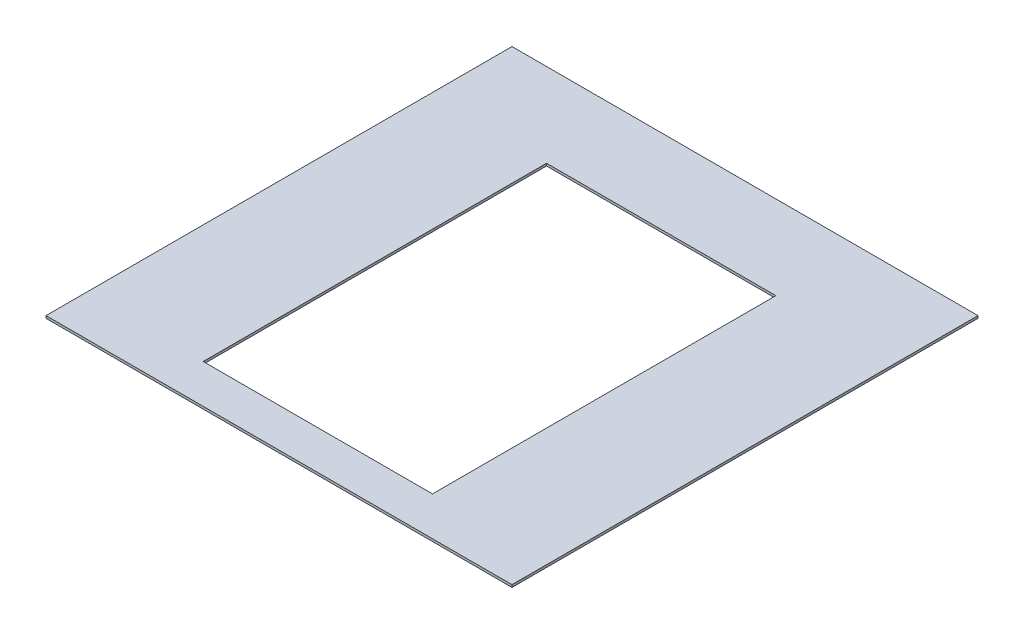
ISO-10303-21;
HEADER;
FILE_DESCRIPTION(('STEP AP214'),'2;1');
FILE_NAME('part.step','',(''),(''),'','','');
FILE_SCHEMA(('AUTOMOTIVE_DESIGN { 1 0 10303 214 1 1 1 1 }'));
ENDSEC;
DATA;
#1=APPLICATION_CONTEXT('core data for automotive mechanical design processes');
#2=APPLICATION_PROTOCOL_DEFINITION('international standard','automotive_design',2000,#1);
#3=PRODUCT_CONTEXT('',#1,'mechanical');
#4=PRODUCT('Part','Part','',(#3));
#5=PRODUCT_RELATED_PRODUCT_CATEGORY('part','',(#4));
#6=PRODUCT_DEFINITION_FORMATION('','',#4);
#7=PRODUCT_DEFINITION_CONTEXT('part definition',#1,'design');
#8=PRODUCT_DEFINITION('design','',#6,#7);
#9=PRODUCT_DEFINITION_SHAPE('','',#8);
#10=(LENGTH_UNIT() NAMED_UNIT(*) SI_UNIT(.MILLI.,.METRE.));
#11=(NAMED_UNIT(*) PLANE_ANGLE_UNIT() SI_UNIT($,.RADIAN.));
#12=(NAMED_UNIT(*) SI_UNIT($,.STERADIAN.) SOLID_ANGLE_UNIT());
#13=UNCERTAINTY_MEASURE_WITH_UNIT(LENGTH_MEASURE(1.E-05),#10,'distance_accuracy_value','');
#14=(GEOMETRIC_REPRESENTATION_CONTEXT(3) GLOBAL_UNCERTAINTY_ASSIGNED_CONTEXT((#13)) GLOBAL_UNIT_ASSIGNED_CONTEXT((#10,
#11,#12)) REPRESENTATION_CONTEXT('',''));
#15=CARTESIAN_POINT('',(0.,0.,0.));
#16=DIRECTION('',(0.,0.,1.));
#17=DIRECTION('',(1.,0.,0.));
#18=AXIS2_PLACEMENT_3D('',#15,#16,#17);
#19=CARTESIAN_POINT('',(0.,1.5875,0.));
#20=DIRECTION('',(0.,-1.,0.));
#21=DIRECTION('',(0.,0.,-1.));
#22=AXIS2_PLACEMENT_3D('',#19,#20,#21);
#23=PLANE('',#22);
#24=DIRECTION('',(0.,0.,-1.));
#25=VECTOR('',#24,1.);
#26=CARTESIAN_POINT('',(304.8,1.5875,304.8));
#27=LINE('',#26,#25);
#28=CARTESIAN_POINT('',(304.8,1.5875,304.8));
#29=VERTEX_POINT('',#28);
#30=CARTESIAN_POINT('',(304.8,1.5875,-304.8));
#31=VERTEX_POINT('',#30);
#32=EDGE_CURVE('E144',#29,#31,#27,.T.);
#33=ORIENTED_EDGE('',*,*,#32,.T.);
#34=DIRECTION('',(-1.,0.,0.));
#35=VECTOR('',#34,1.);
#36=CARTESIAN_POINT('',(-304.8,1.5875,-304.8));
#37=LINE('',#36,#35);
#38=CARTESIAN_POINT('',(-304.8,1.5875,-304.8));
#39=VERTEX_POINT('',#38);
#40=EDGE_CURVE('E147',#31,#39,#37,.T.);
#41=ORIENTED_EDGE('',*,*,#40,.T.);
#42=DIRECTION('',(0.,0.,1.));
#43=VECTOR('',#42,1.);
#44=CARTESIAN_POINT('',(-304.8,1.5875,304.8));
#45=LINE('',#44,#43);
#46=CARTESIAN_POINT('',(-304.8,1.5875,304.8));
#47=VERTEX_POINT('',#46);
#48=EDGE_CURVE('E150',#39,#47,#45,.T.);
#49=ORIENTED_EDGE('',*,*,#48,.T.);
#50=DIRECTION('',(1.,0.,0.));
#51=VECTOR('',#50,1.);
#52=CARTESIAN_POINT('',(-304.8,1.5875,304.8));
#53=LINE('',#52,#51);
#54=EDGE_CURVE('E152',#47,#29,#53,.T.);
#55=ORIENTED_EDGE('',*,*,#54,.T.);
#56=EDGE_LOOP('',(#33,#41,#49,#55));
#57=FACE_BOUND('',#56,.T.);
#58=DIRECTION('',(0.,0.,1.));
#59=VECTOR('',#58,1.);
#60=CARTESIAN_POINT('',(-150.,1.5875,-195.2));
#61=LINE('',#60,#59);
#62=CARTESIAN_POINT('',(-150.,1.5875,-195.2));
#63=VERTEX_POINT('',#62);
#64=CARTESIAN_POINT('',(-150.,1.5875,254.));
#65=VERTEX_POINT('',#64);
#66=EDGE_CURVE('E108',#63,#65,#61,.T.);
#67=ORIENTED_EDGE('',*,*,#66,.F.);
#68=DIRECTION('',(-1.,0.,0.));
#69=VECTOR('',#68,1.);
#70=CARTESIAN_POINT('',(-150.,1.5875,-195.2));
#71=LINE('',#70,#69);
#72=CARTESIAN_POINT('',(150.,1.5875,-195.2));
#73=VERTEX_POINT('',#72);
#74=EDGE_CURVE('E130',#73,#63,#71,.T.);
#75=ORIENTED_EDGE('',*,*,#74,.F.);
#76=DIRECTION('',(0.,0.,-1.));
#77=VECTOR('',#76,1.);
#78=CARTESIAN_POINT('',(150.,1.5875,-195.2));
#79=LINE('',#78,#77);
#80=CARTESIAN_POINT('',(150.,1.5875,254.));
#81=VERTEX_POINT('',#80);
#82=EDGE_CURVE('E128',#81,#73,#79,.T.);
#83=ORIENTED_EDGE('',*,*,#82,.F.);
#84=DIRECTION('',(1.,0.,0.));
#85=VECTOR('',#84,1.);
#86=CARTESIAN_POINT('',(-150.,1.5875,254.));
#87=LINE('',#86,#85);
#88=EDGE_CURVE('E116',#65,#81,#87,.T.);
#89=ORIENTED_EDGE('',*,*,#88,.F.);
#90=EDGE_LOOP('',(#67,#75,#83,#89));
#91=FACE_BOUND('',#90,.T.);
#92=ADVANCED_FACE('F43',(#57,#91),#23,.F.);
#93=CARTESIAN_POINT('',(0.,-1.5875,0.));
#94=DIRECTION('',(0.,-1.,0.));
#95=DIRECTION('',(0.,0.,-1.));
#96=AXIS2_PLACEMENT_3D('',#93,#94,#95);
#97=PLANE('',#96);
#98=DIRECTION('',(0.,0.,-1.));
#99=VECTOR('',#98,1.);
#100=CARTESIAN_POINT('',(304.8,-1.5875,304.8));
#101=LINE('',#100,#99);
#102=CARTESIAN_POINT('',(304.8,-1.5875,304.8));
#103=VERTEX_POINT('',#102);
#104=CARTESIAN_POINT('',(304.8,-1.5875,-304.8));
#105=VERTEX_POINT('',#104);
#106=EDGE_CURVE('E124',#103,#105,#101,.T.);
#107=ORIENTED_EDGE('',*,*,#106,.F.);
#108=DIRECTION('',(1.,0.,0.));
#109=VECTOR('',#108,1.);
#110=CARTESIAN_POINT('',(-304.8,-1.5875,304.8));
#111=LINE('',#110,#109);
#112=CARTESIAN_POINT('',(-304.8,-1.5875,304.8));
#113=VERTEX_POINT('',#112);
#114=EDGE_CURVE('E148',#113,#103,#111,.T.);
#115=ORIENTED_EDGE('',*,*,#114,.F.);
#116=DIRECTION('',(0.,0.,1.));
#117=VECTOR('',#116,1.);
#118=CARTESIAN_POINT('',(-304.8,-1.5875,304.8));
#119=LINE('',#118,#117);
#120=CARTESIAN_POINT('',(-304.8,-1.5875,-304.8));
#121=VERTEX_POINT('',#120);
#122=EDGE_CURVE('E159',#121,#113,#119,.T.);
#123=ORIENTED_EDGE('',*,*,#122,.F.);
#124=DIRECTION('',(-1.,0.,0.));
#125=VECTOR('',#124,1.);
#126=CARTESIAN_POINT('',(-304.8,-1.5875,-304.8));
#127=LINE('',#126,#125);
#128=EDGE_CURVE('E157',#105,#121,#127,.T.);
#129=ORIENTED_EDGE('',*,*,#128,.F.);
#130=EDGE_LOOP('',(#107,#115,#123,#129));
#131=FACE_BOUND('',#130,.T.);
#132=DIRECTION('',(-1.,0.,0.));
#133=VECTOR('',#132,1.);
#134=CARTESIAN_POINT('',(-150.,-1.5875,-195.2));
#135=LINE('',#134,#133);
#136=CARTESIAN_POINT('',(150.,-1.5875,-195.2));
#137=VERTEX_POINT('',#136);
#138=CARTESIAN_POINT('',(-150.,-1.5875,-195.2));
#139=VERTEX_POINT('',#138);
#140=EDGE_CURVE('E117',#137,#139,#135,.T.);
#141=ORIENTED_EDGE('',*,*,#140,.T.);
#142=DIRECTION('',(0.,0.,1.));
#143=VECTOR('',#142,1.);
#144=CARTESIAN_POINT('',(-150.,-1.5875,-195.2));
#145=LINE('',#144,#143);
#146=CARTESIAN_POINT('',(-150.,-1.5875,254.));
#147=VERTEX_POINT('',#146);
#148=EDGE_CURVE('E66',#139,#147,#145,.T.);
#149=ORIENTED_EDGE('',*,*,#148,.T.);
#150=DIRECTION('',(1.,0.,0.));
#151=VECTOR('',#150,1.);
#152=CARTESIAN_POINT('',(-150.,-1.5875,254.));
#153=LINE('',#152,#151);
#154=CARTESIAN_POINT('',(150.,-1.5875,254.));
#155=VERTEX_POINT('',#154);
#156=EDGE_CURVE('E123',#147,#155,#153,.T.);
#157=ORIENTED_EDGE('',*,*,#156,.T.);
#158=DIRECTION('',(0.,0.,-1.));
#159=VECTOR('',#158,1.);
#160=CARTESIAN_POINT('',(150.,-1.5875,-195.2));
#161=LINE('',#160,#159);
#162=EDGE_CURVE('E136',#155,#137,#161,.T.);
#163=ORIENTED_EDGE('',*,*,#162,.T.);
#164=EDGE_LOOP('',(#141,#149,#157,#163));
#165=FACE_BOUND('',#164,.T.);
#166=ADVANCED_FACE('F177',(#131,#165),#97,.T.);
#167=CARTESIAN_POINT('',(304.8,1.5875,304.8));
#168=DIRECTION('',(-1.,0.,0.));
#169=DIRECTION('',(0.,0.,1.));
#170=AXIS2_PLACEMENT_3D('',#167,#168,#169);
#171=PLANE('',#170);
#172=ORIENTED_EDGE('',*,*,#106,.T.);
#173=DIRECTION('',(0.,-1.,0.));
#174=VECTOR('',#173,1.);
#175=CARTESIAN_POINT('',(304.8,1.5875,-304.8));
#176=LINE('',#175,#174);
#177=EDGE_CURVE('E11',#31,#105,#176,.T.);
#178=ORIENTED_EDGE('',*,*,#177,.F.);
#179=ORIENTED_EDGE('',*,*,#32,.F.);
#180=DIRECTION('',(0.,-1.,0.));
#181=VECTOR('',#180,1.);
#182=CARTESIAN_POINT('',(304.8,1.5875,304.8));
#183=LINE('',#182,#181);
#184=EDGE_CURVE('E154',#29,#103,#183,.T.);
#185=ORIENTED_EDGE('',*,*,#184,.T.);
#186=EDGE_LOOP('',(#172,#178,#179,#185));
#187=FACE_BOUND('',#186,.T.);
#188=ADVANCED_FACE('F45',(#187),#171,.F.);
#189=CARTESIAN_POINT('',(-304.8,1.5875,-304.8));
#190=DIRECTION('',(0.,0.,1.));
#191=DIRECTION('',(1.,0.,0.));
#192=AXIS2_PLACEMENT_3D('',#189,#190,#191);
#193=PLANE('',#192);
#194=ORIENTED_EDGE('',*,*,#128,.T.);
#195=DIRECTION('',(0.,-1.,0.));
#196=VECTOR('',#195,1.);
#197=CARTESIAN_POINT('',(-304.8,1.5875,-304.8));
#198=LINE('',#197,#196);
#199=EDGE_CURVE('E51',#39,#121,#198,.T.);
#200=ORIENTED_EDGE('',*,*,#199,.F.);
#201=ORIENTED_EDGE('',*,*,#40,.F.);
#202=ORIENTED_EDGE('',*,*,#177,.T.);
#203=EDGE_LOOP('',(#194,#200,#201,#202));
#204=FACE_BOUND('',#203,.T.);
#205=ADVANCED_FACE('F187',(#204),#193,.F.);
#206=CARTESIAN_POINT('',(-304.8,1.5875,304.8));
#207=DIRECTION('',(1.,0.,0.));
#208=DIRECTION('',(0.,0.,-1.));
#209=AXIS2_PLACEMENT_3D('',#206,#207,#208);
#210=PLANE('',#209);
#211=ORIENTED_EDGE('',*,*,#122,.T.);
#212=DIRECTION('',(0.,-1.,0.));
#213=VECTOR('',#212,1.);
#214=CARTESIAN_POINT('',(-304.8,1.5875,304.8));
#215=LINE('',#214,#213);
#216=EDGE_CURVE('E164',#47,#113,#215,.T.);
#217=ORIENTED_EDGE('',*,*,#216,.F.);
#218=ORIENTED_EDGE('',*,*,#48,.F.);
#219=ORIENTED_EDGE('',*,*,#199,.T.);
#220=EDGE_LOOP('',(#211,#217,#218,#219));
#221=FACE_BOUND('',#220,.T.);
#222=ADVANCED_FACE('F171',(#221),#210,.F.);
#223=CARTESIAN_POINT('',(-304.8,1.5875,304.8));
#224=DIRECTION('',(0.,0.,-1.));
#225=DIRECTION('',(-1.,0.,0.));
#226=AXIS2_PLACEMENT_3D('',#223,#224,#225);
#227=PLANE('',#226);
#228=ORIENTED_EDGE('',*,*,#114,.T.);
#229=ORIENTED_EDGE('',*,*,#184,.F.);
#230=ORIENTED_EDGE('',*,*,#54,.F.);
#231=ORIENTED_EDGE('',*,*,#216,.T.);
#232=EDGE_LOOP('',(#228,#229,#230,#231));
#233=FACE_BOUND('',#232,.T.);
#234=ADVANCED_FACE('F181',(#233),#227,.F.);
#235=CARTESIAN_POINT('',(-150.,1.5875,-195.2));
#236=DIRECTION('',(1.,0.,0.));
#237=DIRECTION('',(0.,0.,-1.));
#238=AXIS2_PLACEMENT_3D('',#235,#236,#237);
#239=PLANE('',#238);
#240=ORIENTED_EDGE('',*,*,#148,.F.);
#241=DIRECTION('',(0.,-1.,0.));
#242=VECTOR('',#241,1.);
#243=CARTESIAN_POINT('',(-150.,1.5875,-195.2));
#244=LINE('',#243,#242);
#245=EDGE_CURVE('E112',#63,#139,#244,.T.);
#246=ORIENTED_EDGE('',*,*,#245,.F.);
#247=ORIENTED_EDGE('',*,*,#66,.T.);
#248=DIRECTION('',(0.,-1.,0.));
#249=VECTOR('',#248,1.);
#250=CARTESIAN_POINT('',(-150.,1.5875,254.));
#251=LINE('',#250,#249);
#252=EDGE_CURVE('E111',#65,#147,#251,.T.);
#253=ORIENTED_EDGE('',*,*,#252,.T.);
#254=EDGE_LOOP('',(#240,#246,#247,#253));
#255=FACE_BOUND('',#254,.T.);
#256=ADVANCED_FACE('F110',(#255),#239,.T.);
#257=CARTESIAN_POINT('',(-150.,1.5875,254.));
#258=DIRECTION('',(0.,0.,-1.));
#259=DIRECTION('',(-1.,0.,0.));
#260=AXIS2_PLACEMENT_3D('',#257,#258,#259);
#261=PLANE('',#260);
#262=ORIENTED_EDGE('',*,*,#156,.F.);
#263=ORIENTED_EDGE('',*,*,#252,.F.);
#264=ORIENTED_EDGE('',*,*,#88,.T.);
#265=DIRECTION('',(0.,-1.,0.));
#266=VECTOR('',#265,1.);
#267=CARTESIAN_POINT('',(150.,1.5875,254.));
#268=LINE('',#267,#266);
#269=EDGE_CURVE('E125',#81,#155,#268,.T.);
#270=ORIENTED_EDGE('',*,*,#269,.T.);
#271=EDGE_LOOP('',(#262,#263,#264,#270));
#272=FACE_BOUND('',#271,.T.);
#273=ADVANCED_FACE('F120',(#272),#261,.T.);
#274=CARTESIAN_POINT('',(150.,1.5875,-195.2));
#275=DIRECTION('',(-1.,0.,0.));
#276=DIRECTION('',(0.,0.,1.));
#277=AXIS2_PLACEMENT_3D('',#274,#275,#276);
#278=PLANE('',#277);
#279=ORIENTED_EDGE('',*,*,#162,.F.);
#280=ORIENTED_EDGE('',*,*,#269,.F.);
#281=ORIENTED_EDGE('',*,*,#82,.T.);
#282=DIRECTION('',(0.,-1.,0.));
#283=VECTOR('',#282,1.);
#284=CARTESIAN_POINT('',(150.,1.5875,-195.2));
#285=LINE('',#284,#283);
#286=EDGE_CURVE('E58',#73,#137,#285,.T.);
#287=ORIENTED_EDGE('',*,*,#286,.T.);
#288=EDGE_LOOP('',(#279,#280,#281,#287));
#289=FACE_BOUND('',#288,.T.);
#290=ADVANCED_FACE('F210',(#289),#278,.T.);
#291=CARTESIAN_POINT('',(-150.,1.5875,-195.2));
#292=DIRECTION('',(0.,0.,1.));
#293=DIRECTION('',(1.,0.,0.));
#294=AXIS2_PLACEMENT_3D('',#291,#292,#293);
#295=PLANE('',#294);
#296=ORIENTED_EDGE('',*,*,#140,.F.);
#297=ORIENTED_EDGE('',*,*,#286,.F.);
#298=ORIENTED_EDGE('',*,*,#74,.T.);
#299=ORIENTED_EDGE('',*,*,#245,.T.);
#300=EDGE_LOOP('',(#296,#297,#298,#299));
#301=FACE_BOUND('',#300,.T.);
#302=ADVANCED_FACE('F214',(#301),#295,.T.);
#303=CLOSED_SHELL('',(#92,#166,#188,#205,#222,#234,#256,#273,#290,#302));
#304=MANIFOLD_SOLID_BREP('B2',#303);
#305=ADVANCED_BREP_SHAPE_REPRESENTATION('',(#18,#304),#14);
#306=SHAPE_DEFINITION_REPRESENTATION(#9,#305);
ENDSEC;
END-ISO-10303-21;
